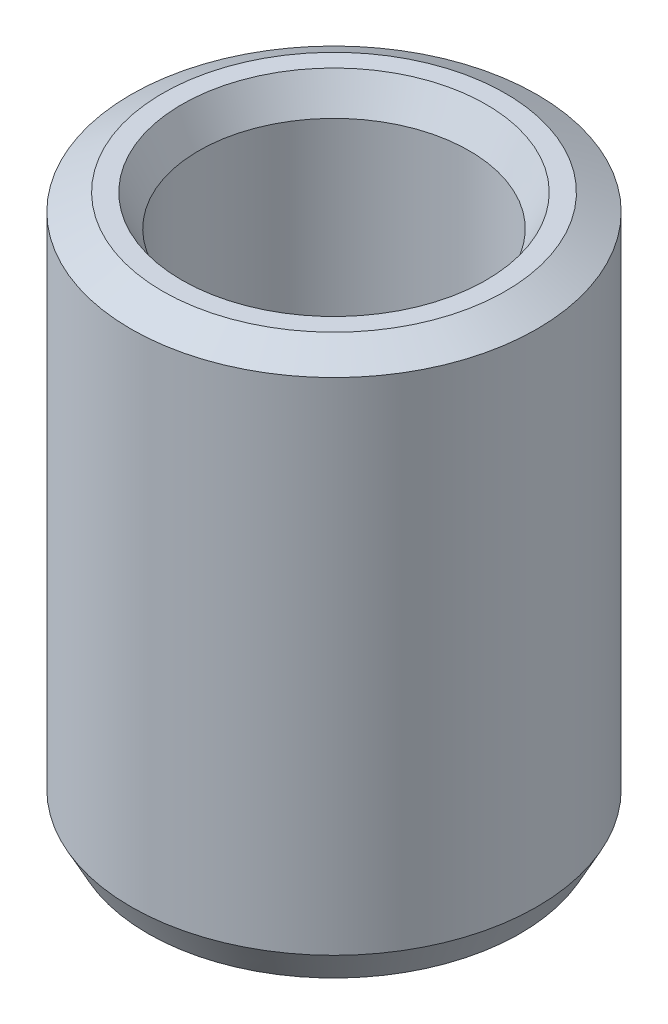
ISO-10303-21;
HEADER;
FILE_DESCRIPTION(('STEP AP214'),'2;1');
FILE_NAME('part.step','',(''),(''),'','','');
FILE_SCHEMA(('AUTOMOTIVE_DESIGN { 1 0 10303 214 1 1 1 1 }'));
ENDSEC;
DATA;
#1=APPLICATION_CONTEXT('core data for automotive mechanical design processes');
#2=APPLICATION_PROTOCOL_DEFINITION('international standard','automotive_design',2000,#1);
#3=PRODUCT_CONTEXT('',#1,'mechanical');
#4=PRODUCT('Part','Part','',(#3));
#5=PRODUCT_RELATED_PRODUCT_CATEGORY('part','',(#4));
#6=PRODUCT_DEFINITION_FORMATION('','',#4);
#7=PRODUCT_DEFINITION_CONTEXT('part definition',#1,'design');
#8=PRODUCT_DEFINITION('design','',#6,#7);
#9=PRODUCT_DEFINITION_SHAPE('','',#8);
#10=(LENGTH_UNIT() NAMED_UNIT(*) SI_UNIT(.MILLI.,.METRE.));
#11=(NAMED_UNIT(*) PLANE_ANGLE_UNIT() SI_UNIT($,.RADIAN.));
#12=(NAMED_UNIT(*) SI_UNIT($,.STERADIAN.) SOLID_ANGLE_UNIT());
#13=UNCERTAINTY_MEASURE_WITH_UNIT(LENGTH_MEASURE(1.E-05),#10,'distance_accuracy_value','');
#14=(GEOMETRIC_REPRESENTATION_CONTEXT(3) GLOBAL_UNCERTAINTY_ASSIGNED_CONTEXT((#13)) GLOBAL_UNIT_ASSIGNED_CONTEXT((#10,
#11,#12)) REPRESENTATION_CONTEXT('',''));
#15=CARTESIAN_POINT('',(0.,0.,0.));
#16=DIRECTION('',(0.,0.,1.));
#17=DIRECTION('',(1.,0.,0.));
#18=AXIS2_PLACEMENT_3D('',#15,#16,#17);
#19=CARTESIAN_POINT('',(0.,128.397365200046,0.));
#20=DIRECTION('',(0.,-1.,0.));
#21=DIRECTION('',(0.,0.,-1.));
#22=AXIS2_PLACEMENT_3D('',#19,#20,#21);
#23=CYLINDRICAL_SURFACE('',#22,47.5);
#24=CARTESIAN_POINT('',(0.,7.39890454876894,0.));
#25=DIRECTION('',(0.,1.,0.));
#26=DIRECTION('',(0.,0.,1.));
#27=AXIS2_PLACEMENT_3D('',#24,#25,#26);
#28=CIRCLE('',#27,47.5);
#29=CARTESIAN_POINT('',(0.,7.39890454876894,47.5));
#30=VERTEX_POINT('',#29);
#31=EDGE_CURVE('E10',#30,#30,#28,.T.);
#32=ORIENTED_EDGE('',*,*,#31,.T.);
#33=EDGE_LOOP('',(#32));
#34=FACE_BOUND('',#33,.T.);
#35=CARTESIAN_POINT('',(0.,124.439842305893,0.));
#36=DIRECTION('',(0.,1.,0.));
#37=DIRECTION('',(0.,0.,1.));
#38=AXIS2_PLACEMENT_3D('',#35,#36,#37);
#39=CIRCLE('',#38,47.5);
#40=CARTESIAN_POINT('',(0.,124.439842305893,47.5));
#41=VERTEX_POINT('',#40);
#42=EDGE_CURVE('E50',#41,#41,#39,.F.);
#43=ORIENTED_EDGE('',*,*,#42,.T.);
#44=EDGE_LOOP('',(#43));
#45=FACE_BOUND('',#44,.T.);
#46=ADVANCED_FACE('F39',(#34,#45),#23,.T.);
#47=CARTESIAN_POINT('',(0.,128.397365200046,0.));
#48=DIRECTION('',(0.,1.,0.));
#49=DIRECTION('',(0.,0.,1.));
#50=AXIS2_PLACEMENT_3D('',#47,#48,#49);
#51=PLANE('',#50);
#52=CARTESIAN_POINT('',(0.,128.397365200046,0.));
#53=DIRECTION('',(0.,1.,0.));
#54=DIRECTION('',(0.,0.,1.));
#55=AXIS2_PLACEMENT_3D('',#52,#53,#54);
#56=CIRCLE('',#55,35.6017970643932);
#57=CARTESIAN_POINT('',(0.,128.397365200046,35.6017970643932));
#58=VERTEX_POINT('',#57);
#59=EDGE_CURVE('E58',#58,#58,#56,.F.);
#60=ORIENTED_EDGE('',*,*,#59,.T.);
#61=EDGE_LOOP('',(#60));
#62=FACE_BOUND('',#61,.T.);
#63=CARTESIAN_POINT('',(0.,128.397365200046,0.));
#64=DIRECTION('',(0.,1.,0.));
#65=DIRECTION('',(0.,0.,1.));
#66=AXIS2_PLACEMENT_3D('',#63,#64,#65);
#67=CIRCLE('',#66,40.101095451231);
#68=CARTESIAN_POINT('',(0.,128.397365200046,40.101095451231));
#69=VERTEX_POINT('',#68);
#70=EDGE_CURVE('E61',#69,#69,#67,.T.);
#71=ORIENTED_EDGE('',*,*,#70,.T.);
#72=EDGE_LOOP('',(#71));
#73=FACE_BOUND('',#72,.T.);
#74=ADVANCED_FACE('F88',(#62,#73),#51,.T.);
#75=CARTESIAN_POINT('',(0.,0.,0.));
#76=DIRECTION('',(0.,1.,0.));
#77=DIRECTION('',(0.,0.,1.));
#78=AXIS2_PLACEMENT_3D('',#75,#76,#77);
#79=PLANE('',#78);
#80=CARTESIAN_POINT('',(0.,0.,0.));
#81=DIRECTION('',(0.,1.,0.));
#82=DIRECTION('',(0.,0.,1.));
#83=AXIS2_PLACEMENT_3D('',#80,#81,#82);
#84=CIRCLE('',#83,39.0431787190086);
#85=CARTESIAN_POINT('',(0.,0.,39.0431787190086));
#86=VERTEX_POINT('',#85);
#87=EDGE_CURVE('E51',#86,#86,#84,.T.);
#88=ORIENTED_EDGE('',*,*,#87,.T.);
#89=EDGE_LOOP('',(#88));
#90=FACE_BOUND('',#89,.T.);
#91=CARTESIAN_POINT('',(0.,0.,0.));
#92=DIRECTION('',(0.,1.,0.));
#93=DIRECTION('',(0.,0.,1.));
#94=AXIS2_PLACEMENT_3D('',#91,#92,#93);
#95=CIRCLE('',#94,43.5424771058466);
#96=CARTESIAN_POINT('',(0.,0.,43.5424771058466));
#97=VERTEX_POINT('',#96);
#98=EDGE_CURVE('E54',#97,#97,#95,.F.);
#99=ORIENTED_EDGE('',*,*,#98,.T.);
#100=EDGE_LOOP('',(#99));
#101=FACE_BOUND('',#100,.T.);
#102=ADVANCED_FACE('F83',(#90,#101),#79,.F.);
#103=CARTESIAN_POINT('',(0.,128.397365200046,0.));
#104=DIRECTION('',(0.,-1.,0.));
#105=DIRECTION('',(0.,0.,-1.));
#106=AXIS2_PLACEMENT_3D('',#103,#104,#105);
#107=CYLINDRICAL_SURFACE('',#106,31.6442741702397);
#108=CARTESIAN_POINT('',(0.,120.998460651277,0.));
#109=DIRECTION('',(0.,1.,0.));
#110=DIRECTION('',(0.,0.,1.));
#111=AXIS2_PLACEMENT_3D('',#108,#109,#110);
#112=CIRCLE('',#111,31.6442741702397);
#113=CARTESIAN_POINT('',(0.,120.998460651277,31.6442741702397));
#114=VERTEX_POINT('',#113);
#115=EDGE_CURVE('E67',#114,#114,#112,.T.);
#116=ORIENTED_EDGE('',*,*,#115,.T.);
#117=EDGE_LOOP('',(#116));
#118=FACE_BOUND('',#117,.T.);
#119=CARTESIAN_POINT('',(0.,3.95752289415345,0.));
#120=DIRECTION('',(0.,1.,0.));
#121=DIRECTION('',(0.,0.,1.));
#122=AXIS2_PLACEMENT_3D('',#119,#120,#121);
#123=CIRCLE('',#122,31.6442741702397);
#124=CARTESIAN_POINT('',(0.,3.95752289415345,31.6442741702397));
#125=VERTEX_POINT('',#124);
#126=EDGE_CURVE('E69',#125,#125,#123,.F.);
#127=ORIENTED_EDGE('',*,*,#126,.T.);
#128=EDGE_LOOP('',(#127));
#129=FACE_BOUND('',#128,.T.);
#130=ADVANCED_FACE('F71',(#118,#129),#107,.F.);
#131=CARTESIAN_POINT('',(0.,120.998460651277,0.));
#132=DIRECTION('',(0.,1.,0.));
#133=DIRECTION('',(0.,0.,1.));
#134=AXIS2_PLACEMENT_3D('',#131,#132,#133);
#135=CONICAL_SURFACE('',#134,31.6442741702397,0.491160371866967);
#136=ORIENTED_EDGE('',*,*,#59,.F.);
#137=EDGE_LOOP('',(#136));
#138=FACE_BOUND('',#137,.T.);
#139=ORIENTED_EDGE('',*,*,#115,.F.);
#140=EDGE_LOOP('',(#139));
#141=FACE_BOUND('',#140,.T.);
#142=ADVANCED_FACE('F77',(#138,#141),#135,.F.);
#143=CARTESIAN_POINT('',(0.,0.,0.));
#144=DIRECTION('',(0.,-1.,0.));
#145=DIRECTION('',(0.,0.,-1.));
#146=AXIS2_PLACEMENT_3D('',#143,#144,#145);
#147=CONICAL_SURFACE('',#146,39.0431787190086,1.07963595492792);
#148=ORIENTED_EDGE('',*,*,#126,.F.);
#149=EDGE_LOOP('',(#148));
#150=FACE_BOUND('',#149,.T.);
#151=ORIENTED_EDGE('',*,*,#87,.F.);
#152=EDGE_LOOP('',(#151));
#153=FACE_BOUND('',#152,.T.);
#154=ADVANCED_FACE('F73',(#150,#153),#147,.F.);
#155=CARTESIAN_POINT('',(0.,7.39890454876894,0.));
#156=DIRECTION('',(0.,1.,0.));
#157=DIRECTION('',(0.,0.,1.));
#158=AXIS2_PLACEMENT_3D('',#155,#156,#157);
#159=CONICAL_SURFACE('',#158,47.5,0.491160371866971);
#160=CARTESIAN_POINT('',(0.,0.,43.5424771058466));
#161=CARTESIAN_POINT('',(0.,0.0770719223830098,43.5837013026607));
#162=CARTESIAN_POINT('',(0.,0.15414384476602,43.6249254994748));
#163=CARTESIAN_POINT('',(0.,0.308287689532039,43.707373893103));
#164=CARTESIAN_POINT('',(0.,0.385359611915049,43.7485980899171));
#165=CARTESIAN_POINT('',(0.,0.539503456681068,43.8310464835453));
#166=CARTESIAN_POINT('',(0.,0.616575379064078,43.8722706803594));
#167=CARTESIAN_POINT('',(0.,0.770719223830098,43.9547190739876));
#168=CARTESIAN_POINT('',(0.,0.847791146213108,43.9959432708017));
#169=CARTESIAN_POINT('',(0.,1.00193499097913,44.0783916644299));
#170=CARTESIAN_POINT('',(0.,1.07900691336214,44.119615861244));
#171=CARTESIAN_POINT('',(0.,1.23315075812816,44.2020642548721));
#172=CARTESIAN_POINT('',(0.,1.31022268051117,44.2432884516862));
#173=CARTESIAN_POINT('',(0.,1.46436652527719,44.3257368453144));
#174=CARTESIAN_POINT('',(0.,1.5414384476602,44.3669610421285));
#175=CARTESIAN_POINT('',(0.,1.69558229242622,44.4494094357567));
#176=CARTESIAN_POINT('',(0.,1.77265421480922,44.4906336325708));
#177=CARTESIAN_POINT('',(0.,1.92679805957525,44.573082026199));
#178=CARTESIAN_POINT('',(0.,2.00386998195826,44.6143062230131));
#179=CARTESIAN_POINT('',(0.,2.15801382672428,44.6967546166413));
#180=CARTESIAN_POINT('',(0.,2.23508574910728,44.7379788134554));
#181=CARTESIAN_POINT('',(0.,2.3892295938733,44.8204272070836));
#182=CARTESIAN_POINT('',(0.,2.46630151625631,44.8616514038977));
#183=CARTESIAN_POINT('',(0.,2.62044536102233,44.9440997975259));
#184=CARTESIAN_POINT('',(0.,2.69751728340534,44.98532399434));
#185=CARTESIAN_POINT('',(0.,2.85166112817136,45.0677723879682));
#186=CARTESIAN_POINT('',(0.,2.92873305055437,45.1089965847823));
#187=CARTESIAN_POINT('',(0.,3.08287689532039,45.1914449784105));
#188=CARTESIAN_POINT('',(0.,3.1599488177034,45.2326691752246));
#189=CARTESIAN_POINT('',(0.,3.31409266246942,45.3151175688528));
#190=CARTESIAN_POINT('',(0.,3.39116458485243,45.3563417656669));
#191=CARTESIAN_POINT('',(0.,3.54530842961845,45.4387901592951));
#192=CARTESIAN_POINT('',(0.,3.62238035200146,45.4800143561092));
#193=CARTESIAN_POINT('',(0.,3.77652419676748,45.5624627497374));
#194=CARTESIAN_POINT('',(0.,3.85359611915049,45.6036869465515));
#195=CARTESIAN_POINT('',(0.,4.00773996391651,45.6861353401797));
#196=CARTESIAN_POINT('',(0.,4.08481188629952,45.7273595369938));
#197=CARTESIAN_POINT('',(0.,4.23895573106554,45.809807930622));
#198=CARTESIAN_POINT('',(0.,4.31602765344855,45.8510321274361));
#199=CARTESIAN_POINT('',(0.,4.47017149821457,45.9334805210643));
#200=CARTESIAN_POINT('',(0.,4.54724342059758,45.9747047178784));
#201=CARTESIAN_POINT('',(0.,4.7013872653636,46.0571531115066));
#202=CARTESIAN_POINT('',(0.,4.77845918774661,46.0983773083207));
#203=CARTESIAN_POINT('',(0.,4.93260303251263,46.1808257019489));
#204=CARTESIAN_POINT('',(0.,5.00967495489564,46.222049898763));
#205=CARTESIAN_POINT('',(0.,5.16381879966166,46.3044982923912));
#206=CARTESIAN_POINT('',(0.,5.24089072204467,46.3457224892053));
#207=CARTESIAN_POINT('',(0.,5.39503456681069,46.4281708828335));
#208=CARTESIAN_POINT('',(0.,5.4721064891937,46.4693950796475));
#209=CARTESIAN_POINT('',(0.,5.62625033395972,46.5518434732757));
#210=CARTESIAN_POINT('',(0.,5.70332225634273,46.5930676700898));
#211=CARTESIAN_POINT('',(0.,5.85746610110875,46.675516063718));
#212=CARTESIAN_POINT('',(0.,5.93453802349176,46.7167402605321));
#213=CARTESIAN_POINT('',(0.,6.08868186825778,46.7991886541603));
#214=CARTESIAN_POINT('',(0.,6.16575379064079,46.8404128509744));
#215=CARTESIAN_POINT('',(0.,6.31989763540681,46.9228612446026));
#216=CARTESIAN_POINT('',(0.,6.39696955778981,46.9640854414167));
#217=CARTESIAN_POINT('',(0.,6.55111340255583,47.0465338350449));
#218=CARTESIAN_POINT('',(0.,6.62818532493885,47.087758031859));
#219=CARTESIAN_POINT('',(0.,6.78232916970487,47.1702064254872));
#220=CARTESIAN_POINT('',(0.,6.85940109208788,47.2114306223013));
#221=CARTESIAN_POINT('',(0.,7.01354493685389,47.2938790159295));
#222=CARTESIAN_POINT('',(0.,7.0906168592369,47.3351032127436));
#223=CARTESIAN_POINT('',(0.,7.24476070400292,47.4175516063718));
#224=CARTESIAN_POINT('',(0.,7.32183262638594,47.4587758031859));
#225=CARTESIAN_POINT('',(0.,7.39890454876894,47.5));
#226=B_SPLINE_CURVE_WITH_KNOTS('',3,(#160,#161,#162,#163,#164,#165,#166,#167,#168,#169,#170,
#171,#172,#173,#174,#175,#176,#177,#178,#179,#180,#181,#182,#183,#184,#185,#186,#187,#188,#189,
#190,#191,#192,#193,#194,#195,#196,#197,#198,#199,#200,#201,#202,#203,#204,#205,#206,#207,#208,
#209,#210,#211,#212,#213,#214,#215,#216,#217,#218,#219,#220,#221,#222,#223,#224,#225),
.UNSPECIFIED.,.F.,.F.,(4,2,2,2,2,2,2,2,2,2,2,2,2,2,2,2,2,2,2,2,2,2,2,2,2,2,2,2,2,2,2,2,4),(0.,
0.26221296803366,0.524425936067322,0.786638904100984,1.04885187213464,1.31106484016831,
1.57327780820197,1.83549077623563,2.09770374426929,2.35991671230295,2.62212968033661,
2.88434264837027,3.14655561640393,3.4087685844376,3.67098155247126,3.93319452050492,
4.19540748853858,4.45762045657224,4.7198334246059,4.98204639263956,5.24425936067322,
5.50647232870688,5.76868529674055,6.03089826477421,6.29311123280787,6.55532420084153,
6.81753716887519,7.07975013690885,7.34196310494251,7.60417607297617,7.86638904100984,
8.12860200904349,8.39081497707716),.UNSPECIFIED.);
#227=EDGE_CURVE('BSEAM76',#97,#30,#226,.T.);
#228=ORIENTED_EDGE('',*,*,#98,.F.);
#229=ORIENTED_EDGE('',*,*,#31,.F.);
#230=ORIENTED_EDGE('',*,*,#227,.T.);
#231=ORIENTED_EDGE('',*,*,#227,.F.);
#232=EDGE_LOOP('',(#228,#230,#229,#231));
#233=FACE_BOUND('',#232,.T.);
#234=ADVANCED_FACE('F76',(#233),#159,.T.);
#235=CARTESIAN_POINT('',(0.,128.397365200046,0.));
#236=DIRECTION('',(0.,-1.,0.));
#237=DIRECTION('',(0.,0.,-1.));
#238=AXIS2_PLACEMENT_3D('',#235,#236,#237);
#239=CONICAL_SURFACE('',#238,40.101095451231,1.07963595492793);
#240=ORIENTED_EDGE('',*,*,#42,.F.);
#241=EDGE_LOOP('',(#240));
#242=FACE_BOUND('',#241,.T.);
#243=ORIENTED_EDGE('',*,*,#70,.F.);
#244=EDGE_LOOP('',(#243));
#245=FACE_BOUND('',#244,.T.);
#246=ADVANCED_FACE('F45',(#242,#245),#239,.T.);
#247=CLOSED_SHELL('',(#46,#74,#102,#130,#142,#154,#234,#246));
#248=MANIFOLD_SOLID_BREP('B2',#247);
#249=ADVANCED_BREP_SHAPE_REPRESENTATION('',(#18,#248),#14);
#250=SHAPE_DEFINITION_REPRESENTATION(#9,#249);
ENDSEC;
END-ISO-10303-21;
